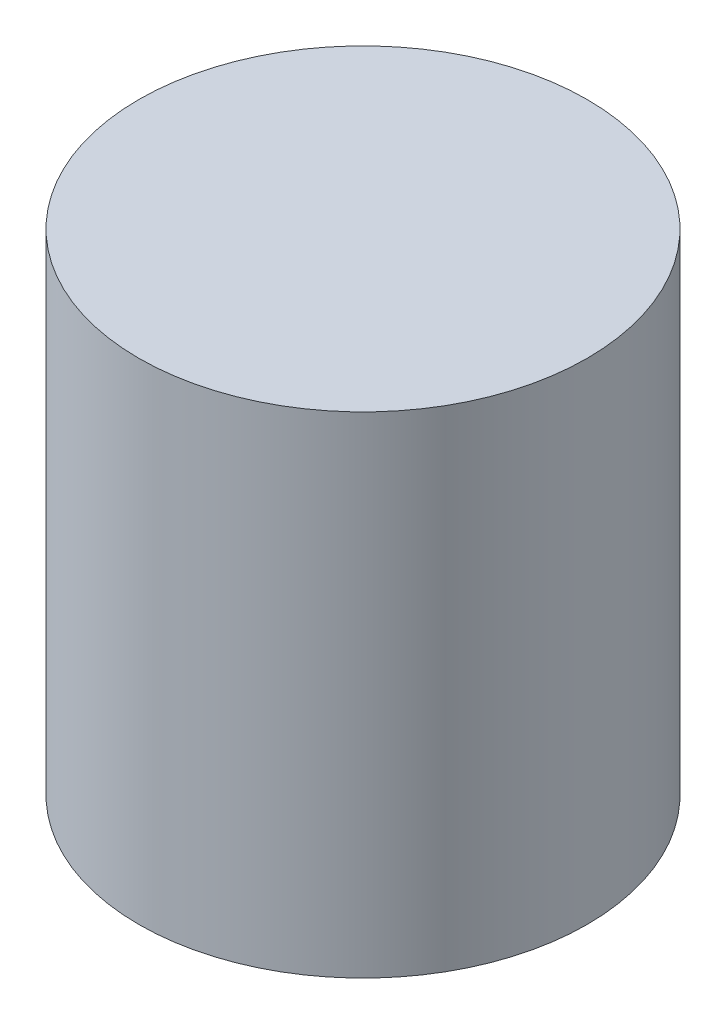
ISO-10303-21;
HEADER;
FILE_DESCRIPTION(('STEP AP214'),'2;1');
FILE_NAME('part.step','',(''),(''),'','','');
FILE_SCHEMA(('AUTOMOTIVE_DESIGN { 1 0 10303 214 1 1 1 1 }'));
ENDSEC;
DATA;
#1=APPLICATION_CONTEXT('core data for automotive mechanical design processes');
#2=APPLICATION_PROTOCOL_DEFINITION('international standard','automotive_design',2000,#1);
#3=PRODUCT_CONTEXT('',#1,'mechanical');
#4=PRODUCT('Part','Part','',(#3));
#5=PRODUCT_RELATED_PRODUCT_CATEGORY('part','',(#4));
#6=PRODUCT_DEFINITION_FORMATION('','',#4);
#7=PRODUCT_DEFINITION_CONTEXT('part definition',#1,'design');
#8=PRODUCT_DEFINITION('design','',#6,#7);
#9=PRODUCT_DEFINITION_SHAPE('','',#8);
#10=(LENGTH_UNIT() NAMED_UNIT(*) SI_UNIT(.MILLI.,.METRE.));
#11=(NAMED_UNIT(*) PLANE_ANGLE_UNIT() SI_UNIT($,.RADIAN.));
#12=(NAMED_UNIT(*) SI_UNIT($,.STERADIAN.) SOLID_ANGLE_UNIT());
#13=UNCERTAINTY_MEASURE_WITH_UNIT(LENGTH_MEASURE(1.E-05),#10,'distance_accuracy_value','');
#14=(GEOMETRIC_REPRESENTATION_CONTEXT(3) GLOBAL_UNCERTAINTY_ASSIGNED_CONTEXT((#13)) GLOBAL_UNIT_ASSIGNED_CONTEXT((#10,
#11,#12)) REPRESENTATION_CONTEXT('',''));
#15=CARTESIAN_POINT('',(0.,0.,0.));
#16=DIRECTION('',(0.,0.,1.));
#17=DIRECTION('',(1.,0.,0.));
#18=AXIS2_PLACEMENT_3D('',#15,#16,#17);
#19=CARTESIAN_POINT('',(0.,35.,0.));
#20=DIRECTION('',(0.,-1.,0.));
#21=DIRECTION('',(0.,0.,-1.));
#22=AXIS2_PLACEMENT_3D('',#19,#20,#21);
#23=CYLINDRICAL_SURFACE('',#22,16.);
#24=CARTESIAN_POINT('',(0.,35.,0.));
#25=DIRECTION('',(0.,1.,0.));
#26=DIRECTION('',(0.,0.,1.));
#27=AXIS2_PLACEMENT_3D('',#24,#25,#26);
#28=CIRCLE('',#27,16.);
#29=CARTESIAN_POINT('',(0.,35.,16.));
#30=VERTEX_POINT('',#29);
#31=EDGE_CURVE('E10',#30,#30,#28,.T.);
#32=ORIENTED_EDGE('',*,*,#31,.F.);
#33=EDGE_LOOP('',(#32));
#34=FACE_BOUND('',#33,.T.);
#35=CARTESIAN_POINT('',(0.,0.,0.));
#36=DIRECTION('',(0.,1.,0.));
#37=DIRECTION('',(0.,0.,1.));
#38=AXIS2_PLACEMENT_3D('',#35,#36,#37);
#39=CIRCLE('',#38,16.);
#40=CARTESIAN_POINT('',(0.,0.,16.));
#41=VERTEX_POINT('',#40);
#42=EDGE_CURVE('E38',#41,#41,#39,.T.);
#43=ORIENTED_EDGE('',*,*,#42,.T.);
#44=EDGE_LOOP('',(#43));
#45=FACE_BOUND('',#44,.T.);
#46=ADVANCED_FACE('F35',(#34,#45),#23,.T.);
#47=CARTESIAN_POINT('',(0.,35.,0.));
#48=DIRECTION('',(0.,1.,0.));
#49=DIRECTION('',(0.,0.,1.));
#50=AXIS2_PLACEMENT_3D('',#47,#48,#49);
#51=PLANE('',#50);
#52=ORIENTED_EDGE('',*,*,#31,.T.);
#53=EDGE_LOOP('',(#52));
#54=FACE_BOUND('',#53,.T.);
#55=ADVANCED_FACE('F50',(#54),#51,.T.);
#56=CARTESIAN_POINT('',(0.,0.,0.));
#57=DIRECTION('',(0.,1.,0.));
#58=DIRECTION('',(0.,0.,1.));
#59=AXIS2_PLACEMENT_3D('',#56,#57,#58);
#60=PLANE('',#59);
#61=ORIENTED_EDGE('',*,*,#42,.F.);
#62=EDGE_LOOP('',(#61));
#63=FACE_BOUND('',#62,.T.);
#64=ADVANCED_FACE('F48',(#63),#60,.F.);
#65=CLOSED_SHELL('',(#46,#55,#64));
#66=MANIFOLD_SOLID_BREP('B2',#65);
#67=ADVANCED_BREP_SHAPE_REPRESENTATION('',(#18,#66),#14);
#68=SHAPE_DEFINITION_REPRESENTATION(#9,#67);
ENDSEC;
END-ISO-10303-21;
